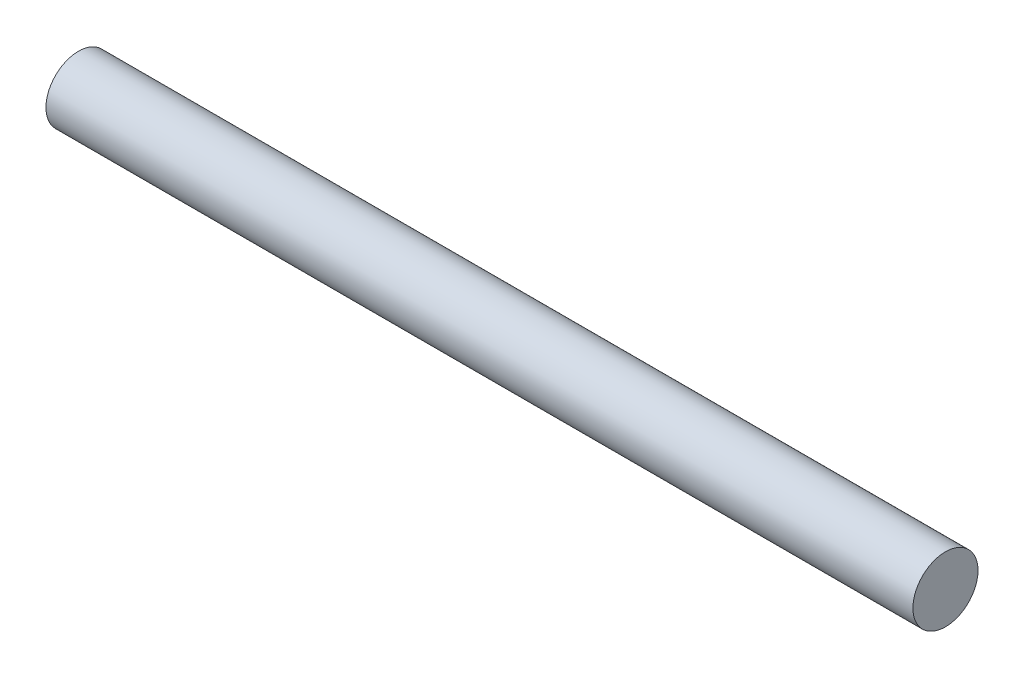
ISO-10303-21;
HEADER;
FILE_DESCRIPTION(('STEP AP214'),'2;1');
FILE_NAME('part.step','',(''),(''),'','','');
FILE_SCHEMA(('AUTOMOTIVE_DESIGN { 1 0 10303 214 1 1 1 1 }'));
ENDSEC;
DATA;
#1=APPLICATION_CONTEXT('core data for automotive mechanical design processes');
#2=APPLICATION_PROTOCOL_DEFINITION('international standard','automotive_design',2000,#1);
#3=PRODUCT_CONTEXT('',#1,'mechanical');
#4=PRODUCT('Part','Part','',(#3));
#5=PRODUCT_RELATED_PRODUCT_CATEGORY('part','',(#4));
#6=PRODUCT_DEFINITION_FORMATION('','',#4);
#7=PRODUCT_DEFINITION_CONTEXT('part definition',#1,'design');
#8=PRODUCT_DEFINITION('design','',#6,#7);
#9=PRODUCT_DEFINITION_SHAPE('','',#8);
#10=(LENGTH_UNIT() NAMED_UNIT(*) SI_UNIT(.MILLI.,.METRE.));
#11=(NAMED_UNIT(*) PLANE_ANGLE_UNIT() SI_UNIT($,.RADIAN.));
#12=(NAMED_UNIT(*) SI_UNIT($,.STERADIAN.) SOLID_ANGLE_UNIT());
#13=UNCERTAINTY_MEASURE_WITH_UNIT(LENGTH_MEASURE(1.E-05),#10,'distance_accuracy_value','');
#14=(GEOMETRIC_REPRESENTATION_CONTEXT(3) GLOBAL_UNCERTAINTY_ASSIGNED_CONTEXT((#13)) GLOBAL_UNIT_ASSIGNED_CONTEXT((#10,
#11,#12)) REPRESENTATION_CONTEXT('',''));
#15=CARTESIAN_POINT('',(0.,0.,0.));
#16=DIRECTION('',(0.,0.,1.));
#17=DIRECTION('',(1.,0.,0.));
#18=AXIS2_PLACEMENT_3D('',#15,#16,#17);
#19=CARTESIAN_POINT('',(169.164,0.,0.));
#20=DIRECTION('',(-1.,0.,0.));
#21=DIRECTION('',(0.,0.,1.));
#22=AXIS2_PLACEMENT_3D('',#19,#20,#21);
#23=CYLINDRICAL_SURFACE('',#22,6.35);
#24=CARTESIAN_POINT('',(169.164,0.,0.));
#25=DIRECTION('',(1.,0.,0.));
#26=DIRECTION('',(0.,0.,-1.));
#27=AXIS2_PLACEMENT_3D('',#24,#25,#26);
#28=CIRCLE('',#27,6.35);
#29=CARTESIAN_POINT('',(169.164,0.,-6.35));
#30=VERTEX_POINT('',#29);
#31=EDGE_CURVE('E10',#30,#30,#28,.T.);
#32=ORIENTED_EDGE('',*,*,#31,.F.);
#33=EDGE_LOOP('',(#32));
#34=FACE_BOUND('',#33,.T.);
#35=CARTESIAN_POINT('',(0.,0.,0.));
#36=DIRECTION('',(1.,0.,0.));
#37=DIRECTION('',(0.,0.,-1.));
#38=AXIS2_PLACEMENT_3D('',#35,#36,#37);
#39=CIRCLE('',#38,6.35);
#40=CARTESIAN_POINT('',(0.,0.,-6.35));
#41=VERTEX_POINT('',#40);
#42=EDGE_CURVE('E34',#41,#41,#39,.T.);
#43=ORIENTED_EDGE('',*,*,#42,.T.);
#44=EDGE_LOOP('',(#43));
#45=FACE_BOUND('',#44,.T.);
#46=ADVANCED_FACE('F31',(#34,#45),#23,.T.);
#47=CARTESIAN_POINT('',(169.164,0.,0.));
#48=DIRECTION('',(1.,0.,0.));
#49=DIRECTION('',(0.,0.,-1.));
#50=AXIS2_PLACEMENT_3D('',#47,#48,#49);
#51=PLANE('',#50);
#52=ORIENTED_EDGE('',*,*,#31,.T.);
#53=EDGE_LOOP('',(#52));
#54=FACE_BOUND('',#53,.T.);
#55=ADVANCED_FACE('F46',(#54),#51,.T.);
#56=CARTESIAN_POINT('',(0.,0.,0.));
#57=DIRECTION('',(1.,0.,0.));
#58=DIRECTION('',(0.,0.,-1.));
#59=AXIS2_PLACEMENT_3D('',#56,#57,#58);
#60=PLANE('',#59);
#61=ORIENTED_EDGE('',*,*,#42,.F.);
#62=EDGE_LOOP('',(#61));
#63=FACE_BOUND('',#62,.T.);
#64=ADVANCED_FACE('F44',(#63),#60,.F.);
#65=CLOSED_SHELL('',(#46,#55,#64));
#66=MANIFOLD_SOLID_BREP('B2',#65);
#67=ADVANCED_BREP_SHAPE_REPRESENTATION('',(#18,#66),#14);
#68=SHAPE_DEFINITION_REPRESENTATION(#9,#67);
ENDSEC;
END-ISO-10303-21;
